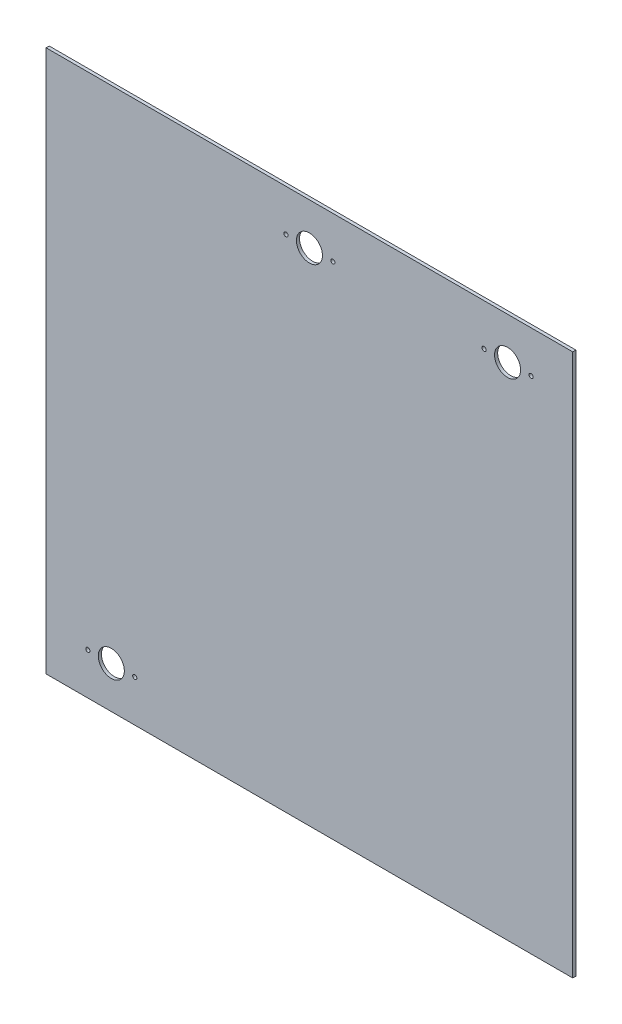
ISO-10303-21;
HEADER;
FILE_DESCRIPTION(('STEP AP214'),'2;1');
FILE_NAME('part.step','',(''),(''),'','','');
FILE_SCHEMA(('AUTOMOTIVE_DESIGN { 1 0 10303 214 1 1 1 1 }'));
ENDSEC;
DATA;
#1=APPLICATION_CONTEXT('core data for automotive mechanical design processes');
#2=APPLICATION_PROTOCOL_DEFINITION('international standard','automotive_design',2000,#1);
#3=PRODUCT_CONTEXT('',#1,'mechanical');
#4=PRODUCT('Part','Part','',(#3));
#5=PRODUCT_RELATED_PRODUCT_CATEGORY('part','',(#4));
#6=PRODUCT_DEFINITION_FORMATION('','',#4);
#7=PRODUCT_DEFINITION_CONTEXT('part definition',#1,'design');
#8=PRODUCT_DEFINITION('design','',#6,#7);
#9=PRODUCT_DEFINITION_SHAPE('','',#8);
#10=(LENGTH_UNIT() NAMED_UNIT(*) SI_UNIT(.MILLI.,.METRE.));
#11=(NAMED_UNIT(*) PLANE_ANGLE_UNIT() SI_UNIT($,.RADIAN.));
#12=(NAMED_UNIT(*) SI_UNIT($,.STERADIAN.) SOLID_ANGLE_UNIT());
#13=UNCERTAINTY_MEASURE_WITH_UNIT(LENGTH_MEASURE(1.E-05),#10,'distance_accuracy_value','');
#14=(GEOMETRIC_REPRESENTATION_CONTEXT(3) GLOBAL_UNCERTAINTY_ASSIGNED_CONTEXT((#13)) GLOBAL_UNIT_ASSIGNED_CONTEXT((#10,
#11,#12)) REPRESENTATION_CONTEXT('',''));
#15=CARTESIAN_POINT('',(0.,0.,0.));
#16=DIRECTION('',(0.,0.,1.));
#17=DIRECTION('',(1.,0.,0.));
#18=AXIS2_PLACEMENT_3D('',#15,#16,#17);
#19=CARTESIAN_POINT('',(0.,0.,3.));
#20=DIRECTION('',(0.,0.,1.));
#21=DIRECTION('',(1.,0.,0.));
#22=AXIS2_PLACEMENT_3D('',#19,#20,#21);
#23=PLANE('',#22);
#24=CARTESIAN_POINT('',(190.,220.,3.));
#25=DIRECTION('',(0.,0.,1.));
#26=DIRECTION('',(1.,0.,0.));
#27=AXIS2_PLACEMENT_3D('',#24,#25,#26);
#28=CIRCLE('',#27,12.5);
#29=CARTESIAN_POINT('',(202.5,220.,3.));
#30=VERTEX_POINT('',#29);
#31=EDGE_CURVE('E151',#30,#30,#28,.T.);
#32=ORIENTED_EDGE('',*,*,#31,.F.);
#33=EDGE_LOOP('',(#32));
#34=FACE_BOUND('',#33,.T.);
#35=CARTESIAN_POINT('',(22.4999999999999,220.,3.));
#36=DIRECTION('',(0.,0.,1.));
#37=DIRECTION('',(1.,0.,0.));
#38=AXIS2_PLACEMENT_3D('',#35,#36,#37);
#39=CIRCLE('',#38,2.);
#40=CARTESIAN_POINT('',(24.4999999999999,220.,3.));
#41=VERTEX_POINT('',#40);
#42=EDGE_CURVE('E139',#41,#41,#39,.T.);
#43=ORIENTED_EDGE('',*,*,#42,.F.);
#44=EDGE_LOOP('',(#43));
#45=FACE_BOUND('',#44,.T.);
#46=CARTESIAN_POINT('',(-22.5,220.,3.));
#47=DIRECTION('',(0.,0.,1.));
#48=DIRECTION('',(1.,0.,0.));
#49=AXIS2_PLACEMENT_3D('',#46,#47,#48);
#50=CIRCLE('',#49,2.);
#51=CARTESIAN_POINT('',(-20.5000000000001,220.,3.));
#52=VERTEX_POINT('',#51);
#53=EDGE_CURVE('E127',#52,#52,#50,.T.);
#54=ORIENTED_EDGE('',*,*,#53,.F.);
#55=EDGE_LOOP('',(#54));
#56=FACE_BOUND('',#55,.T.);
#57=CARTESIAN_POINT('',(-190.,-220.,3.));
#58=DIRECTION('',(0.,0.,1.));
#59=DIRECTION('',(1.,0.,0.));
#60=AXIS2_PLACEMENT_3D('',#57,#58,#59);
#61=CIRCLE('',#60,12.5);
#62=CARTESIAN_POINT('',(-177.5,-220.,3.));
#63=VERTEX_POINT('',#62);
#64=EDGE_CURVE('E115',#63,#63,#61,.T.);
#65=ORIENTED_EDGE('',*,*,#64,.F.);
#66=EDGE_LOOP('',(#65));
#67=FACE_BOUND('',#66,.T.);
#68=DIRECTION('',(0.,1.,0.));
#69=VECTOR('',#68,1.);
#70=CARTESIAN_POINT('',(252.5,260.,3.));
#71=LINE('',#70,#69);
#72=CARTESIAN_POINT('',(252.5,-260.,3.));
#73=VERTEX_POINT('',#72);
#74=CARTESIAN_POINT('',(252.5,260.,3.));
#75=VERTEX_POINT('',#74);
#76=EDGE_CURVE('E85',#73,#75,#71,.T.);
#77=ORIENTED_EDGE('',*,*,#76,.T.);
#78=DIRECTION('',(-1.,0.,0.));
#79=VECTOR('',#78,1.);
#80=CARTESIAN_POINT('',(-252.5,260.,3.));
#81=LINE('',#80,#79);
#82=CARTESIAN_POINT('',(-252.5,260.,3.));
#83=VERTEX_POINT('',#82);
#84=EDGE_CURVE('E80',#75,#83,#81,.T.);
#85=ORIENTED_EDGE('',*,*,#84,.T.);
#86=DIRECTION('',(0.,-1.,0.));
#87=VECTOR('',#86,1.);
#88=CARTESIAN_POINT('',(-252.5,260.,3.));
#89=LINE('',#88,#87);
#90=CARTESIAN_POINT('',(-252.5,-260.,3.));
#91=VERTEX_POINT('',#90);
#92=EDGE_CURVE('E83',#83,#91,#89,.T.);
#93=ORIENTED_EDGE('',*,*,#92,.T.);
#94=DIRECTION('',(1.,0.,0.));
#95=VECTOR('',#94,1.);
#96=CARTESIAN_POINT('',(-252.5,-260.,3.));
#97=LINE('',#96,#95);
#98=EDGE_CURVE('E50',#91,#73,#97,.T.);
#99=ORIENTED_EDGE('',*,*,#98,.T.);
#100=EDGE_LOOP('',(#77,#85,#93,#99));
#101=FACE_BOUND('',#100,.T.);
#102=CARTESIAN_POINT('',(-212.5,-220.,3.));
#103=DIRECTION('',(0.,0.,1.));
#104=DIRECTION('',(1.,0.,0.));
#105=AXIS2_PLACEMENT_3D('',#102,#103,#104);
#106=CIRCLE('',#105,2.);
#107=CARTESIAN_POINT('',(-210.5,-220.,3.));
#108=VERTEX_POINT('',#107);
#109=EDGE_CURVE('E100',#108,#108,#106,.T.);
#110=ORIENTED_EDGE('',*,*,#109,.F.);
#111=EDGE_LOOP('',(#110));
#112=FACE_BOUND('',#111,.T.);
#113=CARTESIAN_POINT('',(-167.5,-220.,3.));
#114=DIRECTION('',(0.,0.,1.));
#115=DIRECTION('',(1.,0.,0.));
#116=AXIS2_PLACEMENT_3D('',#113,#114,#115);
#117=CIRCLE('',#116,2.);
#118=CARTESIAN_POINT('',(-165.5,-220.,3.));
#119=VERTEX_POINT('',#118);
#120=EDGE_CURVE('E121',#119,#119,#117,.T.);
#121=ORIENTED_EDGE('',*,*,#120,.F.);
#122=EDGE_LOOP('',(#121));
#123=FACE_BOUND('',#122,.T.);
#124=CARTESIAN_POINT('',(0.,220.,3.));
#125=DIRECTION('',(0.,0.,1.));
#126=DIRECTION('',(1.,0.,0.));
#127=AXIS2_PLACEMENT_3D('',#124,#125,#126);
#128=CIRCLE('',#127,12.5);
#129=CARTESIAN_POINT('',(12.4999999999999,220.,3.));
#130=VERTEX_POINT('',#129);
#131=EDGE_CURVE('E133',#130,#130,#128,.T.);
#132=ORIENTED_EDGE('',*,*,#131,.F.);
#133=EDGE_LOOP('',(#132));
#134=FACE_BOUND('',#133,.T.);
#135=CARTESIAN_POINT('',(167.5,220.,3.));
#136=DIRECTION('',(0.,0.,1.));
#137=DIRECTION('',(1.,0.,0.));
#138=AXIS2_PLACEMENT_3D('',#135,#136,#137);
#139=CIRCLE('',#138,2.);
#140=CARTESIAN_POINT('',(169.5,220.,3.));
#141=VERTEX_POINT('',#140);
#142=EDGE_CURVE('E145',#141,#141,#139,.T.);
#143=ORIENTED_EDGE('',*,*,#142,.F.);
#144=EDGE_LOOP('',(#143));
#145=FACE_BOUND('',#144,.T.);
#146=CARTESIAN_POINT('',(212.5,220.,3.));
#147=DIRECTION('',(0.,0.,1.));
#148=DIRECTION('',(1.,0.,0.));
#149=AXIS2_PLACEMENT_3D('',#146,#147,#148);
#150=CIRCLE('',#149,2.);
#151=CARTESIAN_POINT('',(214.5,220.,3.));
#152=VERTEX_POINT('',#151);
#153=EDGE_CURVE('E157',#152,#152,#150,.T.);
#154=ORIENTED_EDGE('',*,*,#153,.F.);
#155=EDGE_LOOP('',(#154));
#156=FACE_BOUND('',#155,.T.);
#157=ADVANCED_FACE('F33',(#34,#45,#56,#67,#101,#112,#123,#134,#145,#156),#23,.T.);
#158=CARTESIAN_POINT('',(0.,0.,0.));
#159=DIRECTION('',(0.,0.,1.));
#160=DIRECTION('',(1.,0.,0.));
#161=AXIS2_PLACEMENT_3D('',#158,#159,#160);
#162=PLANE('',#161);
#163=DIRECTION('',(0.,1.,0.));
#164=VECTOR('',#163,1.);
#165=CARTESIAN_POINT('',(252.5,260.,0.));
#166=LINE('',#165,#164);
#167=CARTESIAN_POINT('',(252.5,-260.,0.));
#168=VERTEX_POINT('',#167);
#169=CARTESIAN_POINT('',(252.5,260.,0.));
#170=VERTEX_POINT('',#169);
#171=EDGE_CURVE('E97',#168,#170,#166,.T.);
#172=ORIENTED_EDGE('',*,*,#171,.F.);
#173=DIRECTION('',(1.,0.,0.));
#174=VECTOR('',#173,1.);
#175=CARTESIAN_POINT('',(-252.5,-260.,0.));
#176=LINE('',#175,#174);
#177=CARTESIAN_POINT('',(-252.5,-260.,0.));
#178=VERTEX_POINT('',#177);
#179=EDGE_CURVE('E73',#178,#168,#176,.T.);
#180=ORIENTED_EDGE('',*,*,#179,.F.);
#181=DIRECTION('',(0.,-1.,0.));
#182=VECTOR('',#181,1.);
#183=CARTESIAN_POINT('',(-252.5,260.,0.));
#184=LINE('',#183,#182);
#185=CARTESIAN_POINT('',(-252.5,260.,0.));
#186=VERTEX_POINT('',#185);
#187=EDGE_CURVE('E67',#186,#178,#184,.T.);
#188=ORIENTED_EDGE('',*,*,#187,.F.);
#189=DIRECTION('',(-1.,0.,0.));
#190=VECTOR('',#189,1.);
#191=CARTESIAN_POINT('',(-252.5,260.,0.));
#192=LINE('',#191,#190);
#193=EDGE_CURVE('E89',#170,#186,#192,.T.);
#194=ORIENTED_EDGE('',*,*,#193,.F.);
#195=EDGE_LOOP('',(#172,#180,#188,#194));
#196=FACE_BOUND('',#195,.T.);
#197=CARTESIAN_POINT('',(-212.5,-220.,0.));
#198=DIRECTION('',(0.,0.,1.));
#199=DIRECTION('',(1.,0.,0.));
#200=AXIS2_PLACEMENT_3D('',#197,#198,#199);
#201=CIRCLE('',#200,2.);
#202=CARTESIAN_POINT('',(-210.5,-220.,0.));
#203=VERTEX_POINT('',#202);
#204=EDGE_CURVE('E112',#203,#203,#201,.T.);
#205=ORIENTED_EDGE('',*,*,#204,.T.);
#206=EDGE_LOOP('',(#205));
#207=FACE_BOUND('',#206,.T.);
#208=CARTESIAN_POINT('',(-190.,-220.,0.));
#209=DIRECTION('',(0.,0.,1.));
#210=DIRECTION('',(1.,0.,0.));
#211=AXIS2_PLACEMENT_3D('',#208,#209,#210);
#212=CIRCLE('',#211,12.5);
#213=CARTESIAN_POINT('',(-177.5,-220.,0.));
#214=VERTEX_POINT('',#213);
#215=EDGE_CURVE('E118',#214,#214,#212,.T.);
#216=ORIENTED_EDGE('',*,*,#215,.T.);
#217=EDGE_LOOP('',(#216));
#218=FACE_BOUND('',#217,.T.);
#219=CARTESIAN_POINT('',(-167.5,-220.,0.));
#220=DIRECTION('',(0.,0.,1.));
#221=DIRECTION('',(1.,0.,0.));
#222=AXIS2_PLACEMENT_3D('',#219,#220,#221);
#223=CIRCLE('',#222,2.);
#224=CARTESIAN_POINT('',(-165.5,-220.,0.));
#225=VERTEX_POINT('',#224);
#226=EDGE_CURVE('E124',#225,#225,#223,.T.);
#227=ORIENTED_EDGE('',*,*,#226,.T.);
#228=EDGE_LOOP('',(#227));
#229=FACE_BOUND('',#228,.T.);
#230=CARTESIAN_POINT('',(-22.5,220.,0.));
#231=DIRECTION('',(0.,0.,1.));
#232=DIRECTION('',(1.,0.,0.));
#233=AXIS2_PLACEMENT_3D('',#230,#231,#232);
#234=CIRCLE('',#233,2.);
#235=CARTESIAN_POINT('',(-20.5000000000001,220.,0.));
#236=VERTEX_POINT('',#235);
#237=EDGE_CURVE('E130',#236,#236,#234,.T.);
#238=ORIENTED_EDGE('',*,*,#237,.T.);
#239=EDGE_LOOP('',(#238));
#240=FACE_BOUND('',#239,.T.);
#241=CARTESIAN_POINT('',(0.,220.,0.));
#242=DIRECTION('',(0.,0.,1.));
#243=DIRECTION('',(1.,0.,0.));
#244=AXIS2_PLACEMENT_3D('',#241,#242,#243);
#245=CIRCLE('',#244,12.5);
#246=CARTESIAN_POINT('',(12.4999999999999,220.,0.));
#247=VERTEX_POINT('',#246);
#248=EDGE_CURVE('E136',#247,#247,#245,.T.);
#249=ORIENTED_EDGE('',*,*,#248,.T.);
#250=EDGE_LOOP('',(#249));
#251=FACE_BOUND('',#250,.T.);
#252=CARTESIAN_POINT('',(22.4999999999999,220.,0.));
#253=DIRECTION('',(0.,0.,1.));
#254=DIRECTION('',(1.,0.,0.));
#255=AXIS2_PLACEMENT_3D('',#252,#253,#254);
#256=CIRCLE('',#255,2.);
#257=CARTESIAN_POINT('',(24.4999999999999,220.,0.));
#258=VERTEX_POINT('',#257);
#259=EDGE_CURVE('E142',#258,#258,#256,.T.);
#260=ORIENTED_EDGE('',*,*,#259,.T.);
#261=EDGE_LOOP('',(#260));
#262=FACE_BOUND('',#261,.T.);
#263=CARTESIAN_POINT('',(167.5,220.,0.));
#264=DIRECTION('',(0.,0.,1.));
#265=DIRECTION('',(1.,0.,0.));
#266=AXIS2_PLACEMENT_3D('',#263,#264,#265);
#267=CIRCLE('',#266,2.);
#268=CARTESIAN_POINT('',(169.5,220.,0.));
#269=VERTEX_POINT('',#268);
#270=EDGE_CURVE('E148',#269,#269,#267,.T.);
#271=ORIENTED_EDGE('',*,*,#270,.T.);
#272=EDGE_LOOP('',(#271));
#273=FACE_BOUND('',#272,.T.);
#274=CARTESIAN_POINT('',(190.,220.,0.));
#275=DIRECTION('',(0.,0.,1.));
#276=DIRECTION('',(1.,0.,0.));
#277=AXIS2_PLACEMENT_3D('',#274,#275,#276);
#278=CIRCLE('',#277,12.5);
#279=CARTESIAN_POINT('',(202.5,220.,0.));
#280=VERTEX_POINT('',#279);
#281=EDGE_CURVE('E154',#280,#280,#278,.T.);
#282=ORIENTED_EDGE('',*,*,#281,.T.);
#283=EDGE_LOOP('',(#282));
#284=FACE_BOUND('',#283,.T.);
#285=CARTESIAN_POINT('',(212.5,220.,0.));
#286=DIRECTION('',(0.,0.,1.));
#287=DIRECTION('',(1.,0.,0.));
#288=AXIS2_PLACEMENT_3D('',#285,#286,#287);
#289=CIRCLE('',#288,2.);
#290=CARTESIAN_POINT('',(214.5,220.,0.));
#291=VERTEX_POINT('',#290);
#292=EDGE_CURVE('E160',#291,#291,#289,.T.);
#293=ORIENTED_EDGE('',*,*,#292,.T.);
#294=EDGE_LOOP('',(#293));
#295=FACE_BOUND('',#294,.T.);
#296=ADVANCED_FACE('F108',(#196,#207,#218,#229,#240,#251,#262,#273,#284,#295),#162,.F.);
#297=CARTESIAN_POINT('',(252.5,260.,3.));
#298=DIRECTION('',(-1.,0.,0.));
#299=DIRECTION('',(0.,-1.,0.));
#300=AXIS2_PLACEMENT_3D('',#297,#298,#299);
#301=PLANE('',#300);
#302=ORIENTED_EDGE('',*,*,#171,.T.);
#303=DIRECTION('',(0.,0.,-1.));
#304=VECTOR('',#303,1.);
#305=CARTESIAN_POINT('',(252.5,260.,3.));
#306=LINE('',#305,#304);
#307=EDGE_CURVE('E11',#75,#170,#306,.T.);
#308=ORIENTED_EDGE('',*,*,#307,.F.);
#309=ORIENTED_EDGE('',*,*,#76,.F.);
#310=DIRECTION('',(0.,0.,-1.));
#311=VECTOR('',#310,1.);
#312=CARTESIAN_POINT('',(252.5,-260.,3.));
#313=LINE('',#312,#311);
#314=EDGE_CURVE('E93',#73,#168,#313,.T.);
#315=ORIENTED_EDGE('',*,*,#314,.T.);
#316=EDGE_LOOP('',(#302,#308,#309,#315));
#317=FACE_BOUND('',#316,.T.);
#318=ADVANCED_FACE('F35',(#317),#301,.F.);
#319=CARTESIAN_POINT('',(-252.5,260.,3.));
#320=DIRECTION('',(0.,-1.,0.));
#321=DIRECTION('',(0.,0.,-1.));
#322=AXIS2_PLACEMENT_3D('',#319,#320,#321);
#323=PLANE('',#322);
#324=ORIENTED_EDGE('',*,*,#193,.T.);
#325=DIRECTION('',(0.,0.,-1.));
#326=VECTOR('',#325,1.);
#327=CARTESIAN_POINT('',(-252.5,260.,3.));
#328=LINE('',#327,#326);
#329=EDGE_CURVE('E42',#83,#186,#328,.T.);
#330=ORIENTED_EDGE('',*,*,#329,.F.);
#331=ORIENTED_EDGE('',*,*,#84,.F.);
#332=ORIENTED_EDGE('',*,*,#307,.T.);
#333=EDGE_LOOP('',(#324,#330,#331,#332));
#334=FACE_BOUND('',#333,.T.);
#335=ADVANCED_FACE('F88',(#334),#323,.F.);
#336=CARTESIAN_POINT('',(-252.5,260.,3.));
#337=DIRECTION('',(1.,0.,0.));
#338=DIRECTION('',(0.,1.,0.));
#339=AXIS2_PLACEMENT_3D('',#336,#337,#338);
#340=PLANE('',#339);
#341=ORIENTED_EDGE('',*,*,#187,.T.);
#342=DIRECTION('',(0.,0.,-1.));
#343=VECTOR('',#342,1.);
#344=CARTESIAN_POINT('',(-252.5,-260.,3.));
#345=LINE('',#344,#343);
#346=EDGE_CURVE('E90',#91,#178,#345,.T.);
#347=ORIENTED_EDGE('',*,*,#346,.F.);
#348=ORIENTED_EDGE('',*,*,#92,.F.);
#349=ORIENTED_EDGE('',*,*,#329,.T.);
#350=EDGE_LOOP('',(#341,#347,#348,#349));
#351=FACE_BOUND('',#350,.T.);
#352=ADVANCED_FACE('F91',(#351),#340,.F.);
#353=CARTESIAN_POINT('',(-252.5,-260.,3.));
#354=DIRECTION('',(0.,1.,0.));
#355=DIRECTION('',(0.,0.,1.));
#356=AXIS2_PLACEMENT_3D('',#353,#354,#355);
#357=PLANE('',#356);
#358=ORIENTED_EDGE('',*,*,#179,.T.);
#359=ORIENTED_EDGE('',*,*,#314,.F.);
#360=ORIENTED_EDGE('',*,*,#98,.F.);
#361=ORIENTED_EDGE('',*,*,#346,.T.);
#362=EDGE_LOOP('',(#358,#359,#360,#361));
#363=FACE_BOUND('',#362,.T.);
#364=ADVANCED_FACE('F105',(#363),#357,.F.);
#365=CARTESIAN_POINT('',(-212.5,-220.,3.));
#366=DIRECTION('',(0.,0.,-1.));
#367=DIRECTION('',(-1.,0.,0.));
#368=AXIS2_PLACEMENT_3D('',#365,#366,#367);
#369=CYLINDRICAL_SURFACE('',#368,2.);
#370=ORIENTED_EDGE('',*,*,#109,.T.);
#371=EDGE_LOOP('',(#370));
#372=FACE_BOUND('',#371,.T.);
#373=ORIENTED_EDGE('',*,*,#204,.F.);
#374=EDGE_LOOP('',(#373));
#375=FACE_BOUND('',#374,.T.);
#376=ADVANCED_FACE('F179',(#372,#375),#369,.F.);
#377=CARTESIAN_POINT('',(-190.,-220.,3.));
#378=DIRECTION('',(0.,0.,-1.));
#379=DIRECTION('',(-1.,0.,0.));
#380=AXIS2_PLACEMENT_3D('',#377,#378,#379);
#381=CYLINDRICAL_SURFACE('',#380,12.5);
#382=ORIENTED_EDGE('',*,*,#64,.T.);
#383=EDGE_LOOP('',(#382));
#384=FACE_BOUND('',#383,.T.);
#385=ORIENTED_EDGE('',*,*,#215,.F.);
#386=EDGE_LOOP('',(#385));
#387=FACE_BOUND('',#386,.T.);
#388=ADVANCED_FACE('F225',(#384,#387),#381,.F.);
#389=CARTESIAN_POINT('',(-167.5,-220.,3.));
#390=DIRECTION('',(0.,0.,-1.));
#391=DIRECTION('',(-1.,0.,0.));
#392=AXIS2_PLACEMENT_3D('',#389,#390,#391);
#393=CYLINDRICAL_SURFACE('',#392,2.);
#394=ORIENTED_EDGE('',*,*,#120,.T.);
#395=EDGE_LOOP('',(#394));
#396=FACE_BOUND('',#395,.T.);
#397=ORIENTED_EDGE('',*,*,#226,.F.);
#398=EDGE_LOOP('',(#397));
#399=FACE_BOUND('',#398,.T.);
#400=ADVANCED_FACE('F233',(#396,#399),#393,.F.);
#401=CARTESIAN_POINT('',(-22.5,220.,3.));
#402=DIRECTION('',(0.,0.,-1.));
#403=DIRECTION('',(-1.,0.,0.));
#404=AXIS2_PLACEMENT_3D('',#401,#402,#403);
#405=CYLINDRICAL_SURFACE('',#404,2.);
#406=ORIENTED_EDGE('',*,*,#53,.T.);
#407=EDGE_LOOP('',(#406));
#408=FACE_BOUND('',#407,.T.);
#409=ORIENTED_EDGE('',*,*,#237,.F.);
#410=EDGE_LOOP('',(#409));
#411=FACE_BOUND('',#410,.T.);
#412=ADVANCED_FACE('F241',(#408,#411),#405,.F.);
#413=CARTESIAN_POINT('',(0.,220.,3.));
#414=DIRECTION('',(0.,0.,-1.));
#415=DIRECTION('',(-1.,0.,0.));
#416=AXIS2_PLACEMENT_3D('',#413,#414,#415);
#417=CYLINDRICAL_SURFACE('',#416,12.5);
#418=ORIENTED_EDGE('',*,*,#131,.T.);
#419=EDGE_LOOP('',(#418));
#420=FACE_BOUND('',#419,.T.);
#421=ORIENTED_EDGE('',*,*,#248,.F.);
#422=EDGE_LOOP('',(#421));
#423=FACE_BOUND('',#422,.T.);
#424=ADVANCED_FACE('F250',(#420,#423),#417,.F.);
#425=CARTESIAN_POINT('',(22.4999999999999,220.,3.));
#426=DIRECTION('',(0.,0.,-1.));
#427=DIRECTION('',(-1.,0.,0.));
#428=AXIS2_PLACEMENT_3D('',#425,#426,#427);
#429=CYLINDRICAL_SURFACE('',#428,2.);
#430=ORIENTED_EDGE('',*,*,#42,.T.);
#431=EDGE_LOOP('',(#430));
#432=FACE_BOUND('',#431,.T.);
#433=ORIENTED_EDGE('',*,*,#259,.F.);
#434=EDGE_LOOP('',(#433));
#435=FACE_BOUND('',#434,.T.);
#436=ADVANCED_FACE('F259',(#432,#435),#429,.F.);
#437=CARTESIAN_POINT('',(167.5,220.,3.));
#438=DIRECTION('',(0.,0.,-1.));
#439=DIRECTION('',(-1.,0.,0.));
#440=AXIS2_PLACEMENT_3D('',#437,#438,#439);
#441=CYLINDRICAL_SURFACE('',#440,2.);
#442=ORIENTED_EDGE('',*,*,#142,.T.);
#443=EDGE_LOOP('',(#442));
#444=FACE_BOUND('',#443,.T.);
#445=ORIENTED_EDGE('',*,*,#270,.F.);
#446=EDGE_LOOP('',(#445));
#447=FACE_BOUND('',#446,.T.);
#448=ADVANCED_FACE('F268',(#444,#447),#441,.F.);
#449=CARTESIAN_POINT('',(190.,220.,3.));
#450=DIRECTION('',(0.,0.,-1.));
#451=DIRECTION('',(-1.,0.,0.));
#452=AXIS2_PLACEMENT_3D('',#449,#450,#451);
#453=CYLINDRICAL_SURFACE('',#452,12.5);
#454=ORIENTED_EDGE('',*,*,#31,.T.);
#455=EDGE_LOOP('',(#454));
#456=FACE_BOUND('',#455,.T.);
#457=ORIENTED_EDGE('',*,*,#281,.F.);
#458=EDGE_LOOP('',(#457));
#459=FACE_BOUND('',#458,.T.);
#460=ADVANCED_FACE('F277',(#456,#459),#453,.F.);
#461=CARTESIAN_POINT('',(212.5,220.,3.));
#462=DIRECTION('',(0.,0.,-1.));
#463=DIRECTION('',(-1.,0.,0.));
#464=AXIS2_PLACEMENT_3D('',#461,#462,#463);
#465=CYLINDRICAL_SURFACE('',#464,2.);
#466=ORIENTED_EDGE('',*,*,#153,.T.);
#467=EDGE_LOOP('',(#466));
#468=FACE_BOUND('',#467,.T.);
#469=ORIENTED_EDGE('',*,*,#292,.F.);
#470=EDGE_LOOP('',(#469));
#471=FACE_BOUND('',#470,.T.);
#472=ADVANCED_FACE('F166',(#468,#471),#465,.F.);
#473=CLOSED_SHELL('',(#157,#296,#318,#335,#352,#364,#376,#388,#400,#412,#424,#436,#448,#460,#472));
#474=MANIFOLD_SOLID_BREP('B2',#473);
#475=ADVANCED_BREP_SHAPE_REPRESENTATION('',(#18,#474),#14);
#476=SHAPE_DEFINITION_REPRESENTATION(#9,#475);
ENDSEC;
END-ISO-10303-21;
